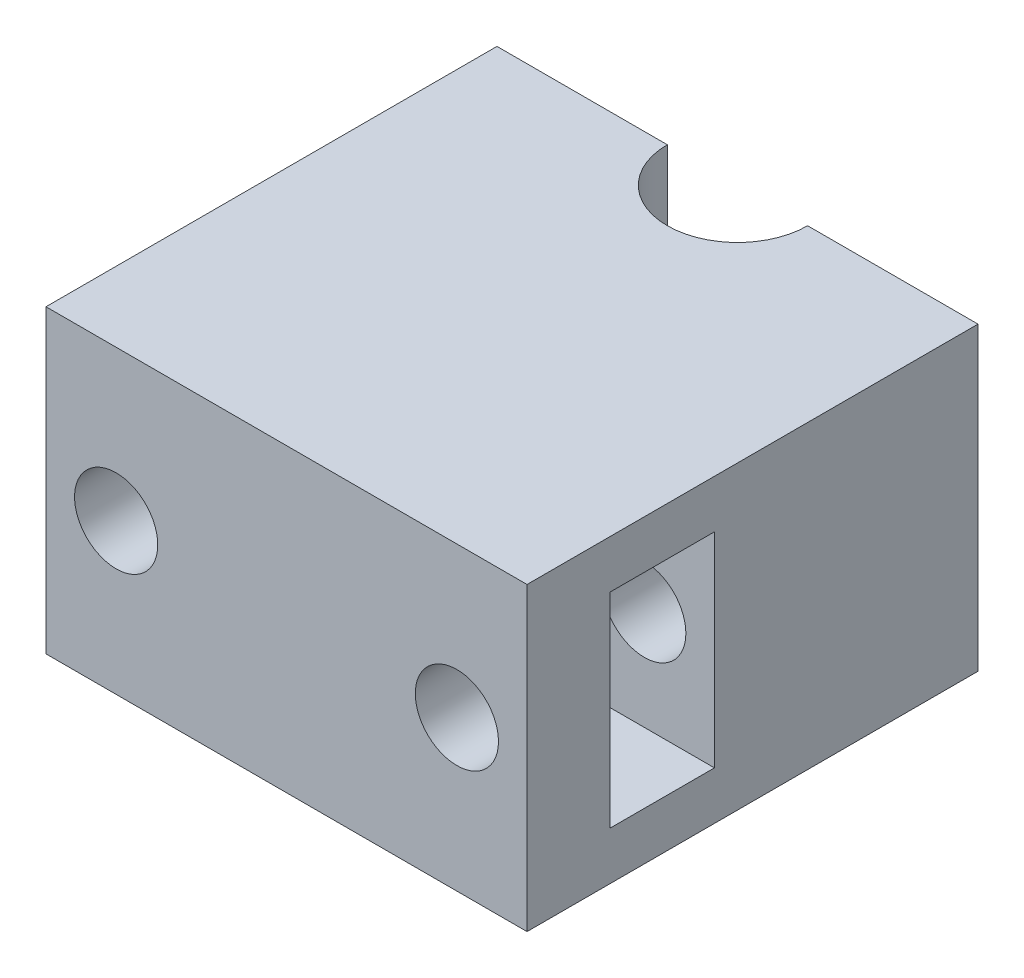
ISO-10303-21;
HEADER;
FILE_DESCRIPTION(('STEP AP214'),'2;1');
FILE_NAME('part.step','',(''),(''),'','','');
FILE_SCHEMA(('AUTOMOTIVE_DESIGN { 1 0 10303 214 1 1 1 1 }'));
ENDSEC;
DATA;
#1=APPLICATION_CONTEXT('core data for automotive mechanical design processes');
#2=APPLICATION_PROTOCOL_DEFINITION('international standard','automotive_design',2000,#1);
#3=PRODUCT_CONTEXT('',#1,'mechanical');
#4=PRODUCT('Part','Part','',(#3));
#5=PRODUCT_RELATED_PRODUCT_CATEGORY('part','',(#4));
#6=PRODUCT_DEFINITION_FORMATION('','',#4);
#7=PRODUCT_DEFINITION_CONTEXT('part definition',#1,'design');
#8=PRODUCT_DEFINITION('design','',#6,#7);
#9=PRODUCT_DEFINITION_SHAPE('','',#8);
#10=(LENGTH_UNIT() NAMED_UNIT(*) SI_UNIT(.MILLI.,.METRE.));
#11=(NAMED_UNIT(*) PLANE_ANGLE_UNIT() SI_UNIT($,.RADIAN.));
#12=(NAMED_UNIT(*) SI_UNIT($,.STERADIAN.) SOLID_ANGLE_UNIT());
#13=UNCERTAINTY_MEASURE_WITH_UNIT(LENGTH_MEASURE(1.E-05),#10,'distance_accuracy_value','');
#14=(GEOMETRIC_REPRESENTATION_CONTEXT(3) GLOBAL_UNCERTAINTY_ASSIGNED_CONTEXT((#13)) GLOBAL_UNIT_ASSIGNED_CONTEXT((#10,
#11,#12)) REPRESENTATION_CONTEXT('',''));
#15=CARTESIAN_POINT('',(0.,0.,0.));
#16=DIRECTION('',(0.,0.,1.));
#17=DIRECTION('',(1.,0.,0.));
#18=AXIS2_PLACEMENT_3D('',#15,#16,#17);
#19=CARTESIAN_POINT('',(24.,30.,-22.5));
#20=DIRECTION('',(0.,0.,1.));
#21=DIRECTION('',(1.,0.,0.));
#22=AXIS2_PLACEMENT_3D('',#19,#20,#21);
#23=PLANE('',#22);
#24=CARTESIAN_POINT('',(-17.,15.,-22.5));
#25=DIRECTION('',(0.,0.,1.));
#26=DIRECTION('',(1.,0.,0.));
#27=AXIS2_PLACEMENT_3D('',#24,#25,#26);
#28=CIRCLE('',#27,4.15);
#29=CARTESIAN_POINT('',(-12.85,15.,-22.5));
#30=VERTEX_POINT('',#29);
#31=EDGE_CURVE('E145',#30,#30,#28,.T.);
#32=ORIENTED_EDGE('',*,*,#31,.T.);
#33=EDGE_LOOP('',(#32));
#34=FACE_BOUND('',#33,.T.);
#35=DIRECTION('',(0.,-1.,0.));
#36=VECTOR('',#35,1.);
#37=CARTESIAN_POINT('',(-7.,157.889780948955,-22.5));
#38=LINE('',#37,#36);
#39=CARTESIAN_POINT('',(-7.,30.,-22.5));
#40=VERTEX_POINT('',#39);
#41=CARTESIAN_POINT('',(-7.,0.,-22.5));
#42=VERTEX_POINT('',#41);
#43=EDGE_CURVE('E126',#40,#42,#38,.T.);
#44=ORIENTED_EDGE('',*,*,#43,.T.);
#45=DIRECTION('',(-1.,0.,0.));
#46=VECTOR('',#45,1.);
#47=CARTESIAN_POINT('',(24.,0.,-22.5));
#48=LINE('',#47,#46);
#49=CARTESIAN_POINT('',(-24.,0.,-22.5));
#50=VERTEX_POINT('',#49);
#51=EDGE_CURVE('E113',#42,#50,#48,.T.);
#52=ORIENTED_EDGE('',*,*,#51,.T.);
#53=DIRECTION('',(0.,-1.,0.));
#54=VECTOR('',#53,1.);
#55=CARTESIAN_POINT('',(-24.,30.,-22.5));
#56=LINE('',#55,#54);
#57=CARTESIAN_POINT('',(-24.,30.,-22.5));
#58=VERTEX_POINT('',#57);
#59=EDGE_CURVE('E195',#58,#50,#56,.T.);
#60=ORIENTED_EDGE('',*,*,#59,.F.);
#61=DIRECTION('',(-1.,0.,0.));
#62=VECTOR('',#61,1.);
#63=CARTESIAN_POINT('',(24.,30.,-22.5));
#64=LINE('',#63,#62);
#65=EDGE_CURVE('E127',#40,#58,#64,.T.);
#66=ORIENTED_EDGE('',*,*,#65,.F.);
#67=EDGE_LOOP('',(#44,#52,#60,#66));
#68=FACE_BOUND('',#67,.T.);
#69=ADVANCED_FACE('F35',(#34,#68),#23,.F.);
#70=CARTESIAN_POINT('',(17.,15.,-22.5));
#71=DIRECTION('',(0.,0.,1.));
#72=DIRECTION('',(1.,0.,0.));
#73=AXIS2_PLACEMENT_3D('',#70,#71,#72);
#74=CIRCLE('',#73,4.15);
#75=CARTESIAN_POINT('',(21.15,15.,-22.5));
#76=VERTEX_POINT('',#75);
#77=EDGE_CURVE('E135',#76,#76,#74,.T.);
#78=ORIENTED_EDGE('',*,*,#77,.T.);
#79=EDGE_LOOP('',(#78));
#80=FACE_BOUND('',#79,.T.);
#81=DIRECTION('',(0.,-1.,0.));
#82=VECTOR('',#81,1.);
#83=CARTESIAN_POINT('',(7.,157.889780948955,-22.5));
#84=LINE('',#83,#82);
#85=CARTESIAN_POINT('',(7.,30.,-22.5));
#86=VERTEX_POINT('',#85);
#87=CARTESIAN_POINT('',(7.,0.,-22.5));
#88=VERTEX_POINT('',#87);
#89=EDGE_CURVE('E58',#86,#88,#84,.T.);
#90=ORIENTED_EDGE('',*,*,#89,.F.);
#91=CARTESIAN_POINT('',(24.,30.,-22.5));
#92=VERTEX_POINT('',#91);
#93=EDGE_CURVE('E193',#92,#86,#64,.T.);
#94=ORIENTED_EDGE('',*,*,#93,.F.);
#95=DIRECTION('',(0.,-1.,0.));
#96=VECTOR('',#95,1.);
#97=CARTESIAN_POINT('',(24.,30.,-22.5));
#98=LINE('',#97,#96);
#99=CARTESIAN_POINT('',(24.,0.,-22.5));
#100=VERTEX_POINT('',#99);
#101=EDGE_CURVE('E201',#92,#100,#98,.T.);
#102=ORIENTED_EDGE('',*,*,#101,.T.);
#103=EDGE_CURVE('E122',#100,#88,#48,.T.);
#104=ORIENTED_EDGE('',*,*,#103,.T.);
#105=EDGE_LOOP('',(#90,#94,#102,#104));
#106=FACE_BOUND('',#105,.T.);
#107=ADVANCED_FACE('F232',(#80,#106),#23,.F.);
#108=CARTESIAN_POINT('',(0.,30.,0.));
#109=DIRECTION('',(0.,1.,0.));
#110=DIRECTION('',(0.,0.,1.));
#111=AXIS2_PLACEMENT_3D('',#108,#109,#110);
#112=PLANE('',#111);
#113=ORIENTED_EDGE('',*,*,#93,.T.);
#114=CARTESIAN_POINT('',(0.,30.,-22.5));
#115=DIRECTION('',(0.,1.,0.));
#116=DIRECTION('',(0.,0.,1.));
#117=AXIS2_PLACEMENT_3D('',#114,#115,#116);
#118=CIRCLE('',#117,7.);
#119=EDGE_CURVE('E50',#86,#40,#118,.F.);
#120=ORIENTED_EDGE('',*,*,#119,.T.);
#121=ORIENTED_EDGE('',*,*,#65,.T.);
#122=DIRECTION('',(0.,0.,1.));
#123=VECTOR('',#122,1.);
#124=CARTESIAN_POINT('',(-24.,30.,22.5));
#125=LINE('',#124,#123);
#126=CARTESIAN_POINT('',(-24.,30.,22.5));
#127=VERTEX_POINT('',#126);
#128=EDGE_CURVE('E186',#58,#127,#125,.T.);
#129=ORIENTED_EDGE('',*,*,#128,.T.);
#130=DIRECTION('',(1.,0.,0.));
#131=VECTOR('',#130,1.);
#132=CARTESIAN_POINT('',(24.,30.,22.5));
#133=LINE('',#132,#131);
#134=CARTESIAN_POINT('',(24.,30.,22.5));
#135=VERTEX_POINT('',#134);
#136=EDGE_CURVE('E189',#127,#135,#133,.T.);
#137=ORIENTED_EDGE('',*,*,#136,.T.);
#138=DIRECTION('',(0.,0.,-1.));
#139=VECTOR('',#138,1.);
#140=CARTESIAN_POINT('',(24.,30.,22.5));
#141=LINE('',#140,#139);
#142=EDGE_CURVE('E191',#135,#92,#141,.T.);
#143=ORIENTED_EDGE('',*,*,#142,.T.);
#144=EDGE_LOOP('',(#113,#120,#121,#129,#137,#143));
#145=FACE_BOUND('',#144,.T.);
#146=ADVANCED_FACE('F238',(#145),#112,.T.);
#147=CARTESIAN_POINT('',(0.,0.,0.));
#148=DIRECTION('',(0.,1.,0.));
#149=DIRECTION('',(0.,0.,1.));
#150=AXIS2_PLACEMENT_3D('',#147,#148,#149);
#151=PLANE('',#150);
#152=CARTESIAN_POINT('',(0.,0.,-22.5));
#153=DIRECTION('',(0.,1.,0.));
#154=DIRECTION('',(0.,0.,1.));
#155=AXIS2_PLACEMENT_3D('',#152,#153,#154);
#156=CIRCLE('',#155,7.);
#157=EDGE_CURVE('E11',#88,#42,#156,.F.);
#158=ORIENTED_EDGE('',*,*,#157,.F.);
#159=ORIENTED_EDGE('',*,*,#103,.F.);
#160=DIRECTION('',(0.,0.,-1.));
#161=VECTOR('',#160,1.);
#162=CARTESIAN_POINT('',(24.,0.,22.5));
#163=LINE('',#162,#161);
#164=CARTESIAN_POINT('',(24.,0.,22.5));
#165=VERTEX_POINT('',#164);
#166=EDGE_CURVE('E123',#165,#100,#163,.T.);
#167=ORIENTED_EDGE('',*,*,#166,.F.);
#168=DIRECTION('',(1.,0.,0.));
#169=VECTOR('',#168,1.);
#170=CARTESIAN_POINT('',(24.,0.,22.5));
#171=LINE('',#170,#169);
#172=CARTESIAN_POINT('',(-24.,0.,22.5));
#173=VERTEX_POINT('',#172);
#174=EDGE_CURVE('E197',#173,#165,#171,.T.);
#175=ORIENTED_EDGE('',*,*,#174,.F.);
#176=DIRECTION('',(0.,0.,1.));
#177=VECTOR('',#176,1.);
#178=CARTESIAN_POINT('',(-24.,0.,22.5));
#179=LINE('',#178,#177);
#180=EDGE_CURVE('E118',#50,#173,#179,.T.);
#181=ORIENTED_EDGE('',*,*,#180,.F.);
#182=ORIENTED_EDGE('',*,*,#51,.F.);
#183=EDGE_LOOP('',(#158,#159,#167,#175,#181,#182));
#184=FACE_BOUND('',#183,.T.);
#185=ADVANCED_FACE('F115',(#184),#151,.F.);
#186=CARTESIAN_POINT('',(-24.,30.,22.5));
#187=DIRECTION('',(1.,0.,0.));
#188=DIRECTION('',(0.,0.,-1.));
#189=AXIS2_PLACEMENT_3D('',#186,#187,#188);
#190=PLANE('',#189);
#191=DIRECTION('',(0.,0.,-1.));
#192=VECTOR('',#191,1.);
#193=CARTESIAN_POINT('',(-24.,4.8,14.2));
#194=LINE('',#193,#192);
#195=CARTESIAN_POINT('',(-24.,4.8,14.2));
#196=VERTEX_POINT('',#195);
#197=CARTESIAN_POINT('',(-24.,4.8,3.80000000000001));
#198=VERTEX_POINT('',#197);
#199=EDGE_CURVE('E165',#196,#198,#194,.T.);
#200=ORIENTED_EDGE('',*,*,#199,.T.);
#201=DIRECTION('',(0.,1.,0.));
#202=VECTOR('',#201,1.);
#203=CARTESIAN_POINT('',(-24.,4.8,3.80000000000001));
#204=LINE('',#203,#202);
#205=CARTESIAN_POINT('',(-24.,25.2,3.80000000000001));
#206=VERTEX_POINT('',#205);
#207=EDGE_CURVE('E155',#198,#206,#204,.T.);
#208=ORIENTED_EDGE('',*,*,#207,.T.);
#209=DIRECTION('',(0.,0.,1.));
#210=VECTOR('',#209,1.);
#211=CARTESIAN_POINT('',(-24.,25.2,14.2));
#212=LINE('',#211,#210);
#213=CARTESIAN_POINT('',(-24.,25.2,14.2));
#214=VERTEX_POINT('',#213);
#215=EDGE_CURVE('E158',#206,#214,#212,.T.);
#216=ORIENTED_EDGE('',*,*,#215,.T.);
#217=DIRECTION('',(0.,-1.,0.));
#218=VECTOR('',#217,1.);
#219=CARTESIAN_POINT('',(-24.,4.8,14.2));
#220=LINE('',#219,#218);
#221=EDGE_CURVE('E162',#214,#196,#220,.T.);
#222=ORIENTED_EDGE('',*,*,#221,.T.);
#223=EDGE_LOOP('',(#200,#208,#216,#222));
#224=FACE_BOUND('',#223,.T.);
#225=ORIENTED_EDGE('',*,*,#180,.T.);
#226=DIRECTION('',(0.,-1.,0.));
#227=VECTOR('',#226,1.);
#228=CARTESIAN_POINT('',(-24.,30.,22.5));
#229=LINE('',#228,#227);
#230=EDGE_CURVE('E43',#127,#173,#229,.T.);
#231=ORIENTED_EDGE('',*,*,#230,.F.);
#232=ORIENTED_EDGE('',*,*,#128,.F.);
#233=ORIENTED_EDGE('',*,*,#59,.T.);
#234=EDGE_LOOP('',(#225,#231,#232,#233));
#235=FACE_BOUND('',#234,.T.);
#236=ADVANCED_FACE('F37',(#224,#235),#190,.F.);
#237=CARTESIAN_POINT('',(24.,30.,22.5));
#238=DIRECTION('',(0.,0.,-1.));
#239=DIRECTION('',(-1.,0.,0.));
#240=AXIS2_PLACEMENT_3D('',#237,#238,#239);
#241=PLANE('',#240);
#242=CARTESIAN_POINT('',(17.,15.,22.5));
#243=DIRECTION('',(0.,0.,1.));
#244=DIRECTION('',(1.,0.,0.));
#245=AXIS2_PLACEMENT_3D('',#242,#243,#244);
#246=CIRCLE('',#245,4.15);
#247=CARTESIAN_POINT('',(21.15,15.,22.5));
#248=VERTEX_POINT('',#247);
#249=EDGE_CURVE('E132',#248,#248,#246,.T.);
#250=ORIENTED_EDGE('',*,*,#249,.F.);
#251=EDGE_LOOP('',(#250));
#252=FACE_BOUND('',#251,.T.);
#253=CARTESIAN_POINT('',(-17.,15.,22.5));
#254=DIRECTION('',(0.,0.,1.));
#255=DIRECTION('',(1.,0.,0.));
#256=AXIS2_PLACEMENT_3D('',#253,#254,#255);
#257=CIRCLE('',#256,4.15);
#258=CARTESIAN_POINT('',(-12.85,15.,22.5));
#259=VERTEX_POINT('',#258);
#260=EDGE_CURVE('E144',#259,#259,#257,.T.);
#261=ORIENTED_EDGE('',*,*,#260,.F.);
#262=EDGE_LOOP('',(#261));
#263=FACE_BOUND('',#262,.T.);
#264=ORIENTED_EDGE('',*,*,#174,.T.);
#265=DIRECTION('',(0.,-1.,0.));
#266=VECTOR('',#265,1.);
#267=CARTESIAN_POINT('',(24.,30.,22.5));
#268=LINE('',#267,#266);
#269=EDGE_CURVE('E204',#135,#165,#268,.T.);
#270=ORIENTED_EDGE('',*,*,#269,.F.);
#271=ORIENTED_EDGE('',*,*,#136,.F.);
#272=ORIENTED_EDGE('',*,*,#230,.T.);
#273=EDGE_LOOP('',(#264,#270,#271,#272));
#274=FACE_BOUND('',#273,.T.);
#275=ADVANCED_FACE('F246',(#252,#263,#274),#241,.F.);
#276=CARTESIAN_POINT('',(24.,30.,22.5));
#277=DIRECTION('',(-1.,0.,0.));
#278=DIRECTION('',(0.,0.,1.));
#279=AXIS2_PLACEMENT_3D('',#276,#277,#278);
#280=PLANE('',#279);
#281=DIRECTION('',(0.,0.,1.));
#282=VECTOR('',#281,1.);
#283=CARTESIAN_POINT('',(24.,25.2,14.2));
#284=LINE('',#283,#282);
#285=CARTESIAN_POINT('',(24.,25.2,3.80000000000001));
#286=VERTEX_POINT('',#285);
#287=CARTESIAN_POINT('',(24.,25.2,14.2));
#288=VERTEX_POINT('',#287);
#289=EDGE_CURVE('E170',#286,#288,#284,.T.);
#290=ORIENTED_EDGE('',*,*,#289,.F.);
#291=DIRECTION('',(0.,1.,0.));
#292=VECTOR('',#291,1.);
#293=CARTESIAN_POINT('',(24.,4.8,3.80000000000001));
#294=LINE('',#293,#292);
#295=CARTESIAN_POINT('',(24.,4.8,3.80000000000001));
#296=VERTEX_POINT('',#295);
#297=EDGE_CURVE('E154',#296,#286,#294,.T.);
#298=ORIENTED_EDGE('',*,*,#297,.F.);
#299=DIRECTION('',(0.,0.,-1.));
#300=VECTOR('',#299,1.);
#301=CARTESIAN_POINT('',(24.,4.8,14.2));
#302=LINE('',#301,#300);
#303=CARTESIAN_POINT('',(24.,4.8,14.2));
#304=VERTEX_POINT('',#303);
#305=EDGE_CURVE('E159',#304,#296,#302,.T.);
#306=ORIENTED_EDGE('',*,*,#305,.F.);
#307=DIRECTION('',(0.,-1.,0.));
#308=VECTOR('',#307,1.);
#309=CARTESIAN_POINT('',(24.,4.8,14.2));
#310=LINE('',#309,#308);
#311=EDGE_CURVE('E173',#288,#304,#310,.T.);
#312=ORIENTED_EDGE('',*,*,#311,.F.);
#313=EDGE_LOOP('',(#290,#298,#306,#312));
#314=FACE_BOUND('',#313,.T.);
#315=ORIENTED_EDGE('',*,*,#166,.T.);
#316=ORIENTED_EDGE('',*,*,#101,.F.);
#317=ORIENTED_EDGE('',*,*,#142,.F.);
#318=ORIENTED_EDGE('',*,*,#269,.T.);
#319=EDGE_LOOP('',(#315,#316,#317,#318));
#320=FACE_BOUND('',#319,.T.);
#321=ADVANCED_FACE('F243',(#314,#320),#280,.F.);
#322=CARTESIAN_POINT('',(-24.,4.8,3.80000000000001));
#323=DIRECTION('',(0.,0.,-1.));
#324=DIRECTION('',(-1.,0.,0.));
#325=AXIS2_PLACEMENT_3D('',#322,#323,#324);
#326=PLANE('',#325);
#327=CARTESIAN_POINT('',(17.,15.,3.80000000000001));
#328=DIRECTION('',(0.,0.,-1.));
#329=DIRECTION('',(-1.,0.,0.));
#330=AXIS2_PLACEMENT_3D('',#327,#328,#329);
#331=CIRCLE('',#330,4.15);
#332=CARTESIAN_POINT('',(12.85,15.,3.80000000000001));
#333=VERTEX_POINT('',#332);
#334=EDGE_CURVE('E141',#333,#333,#331,.T.);
#335=ORIENTED_EDGE('',*,*,#334,.T.);
#336=EDGE_LOOP('',(#335));
#337=FACE_BOUND('',#336,.T.);
#338=CARTESIAN_POINT('',(-17.,15.,3.80000000000001));
#339=DIRECTION('',(0.,0.,-1.));
#340=DIRECTION('',(-1.,0.,0.));
#341=AXIS2_PLACEMENT_3D('',#338,#339,#340);
#342=CIRCLE('',#341,4.15);
#343=CARTESIAN_POINT('',(-21.15,15.,3.80000000000001));
#344=VERTEX_POINT('',#343);
#345=EDGE_CURVE('E151',#344,#344,#342,.T.);
#346=ORIENTED_EDGE('',*,*,#345,.T.);
#347=EDGE_LOOP('',(#346));
#348=FACE_BOUND('',#347,.T.);
#349=ORIENTED_EDGE('',*,*,#297,.T.);
#350=DIRECTION('',(1.,0.,0.));
#351=VECTOR('',#350,1.);
#352=CARTESIAN_POINT('',(-24.,25.2,3.80000000000001));
#353=LINE('',#352,#351);
#354=EDGE_CURVE('E168',#206,#286,#353,.T.);
#355=ORIENTED_EDGE('',*,*,#354,.F.);
#356=ORIENTED_EDGE('',*,*,#207,.F.);
#357=DIRECTION('',(1.,0.,0.));
#358=VECTOR('',#357,1.);
#359=CARTESIAN_POINT('',(-24.,4.8,3.80000000000001));
#360=LINE('',#359,#358);
#361=EDGE_CURVE('E178',#198,#296,#360,.T.);
#362=ORIENTED_EDGE('',*,*,#361,.T.);
#363=EDGE_LOOP('',(#349,#355,#356,#362));
#364=FACE_BOUND('',#363,.T.);
#365=ADVANCED_FACE('F245',(#337,#348,#364),#326,.F.);
#366=CARTESIAN_POINT('',(-24.,4.8,14.2));
#367=DIRECTION('',(0.,-1.,0.));
#368=DIRECTION('',(0.,0.,-1.));
#369=AXIS2_PLACEMENT_3D('',#366,#367,#368);
#370=PLANE('',#369);
#371=ORIENTED_EDGE('',*,*,#305,.T.);
#372=ORIENTED_EDGE('',*,*,#361,.F.);
#373=ORIENTED_EDGE('',*,*,#199,.F.);
#374=DIRECTION('',(1.,0.,0.));
#375=VECTOR('',#374,1.);
#376=CARTESIAN_POINT('',(-24.,4.8,14.2));
#377=LINE('',#376,#375);
#378=EDGE_CURVE('E180',#196,#304,#377,.T.);
#379=ORIENTED_EDGE('',*,*,#378,.T.);
#380=EDGE_LOOP('',(#371,#372,#373,#379));
#381=FACE_BOUND('',#380,.T.);
#382=ADVANCED_FACE('F273',(#381),#370,.F.);
#383=CARTESIAN_POINT('',(-24.,4.8,14.2));
#384=DIRECTION('',(0.,0.,1.));
#385=DIRECTION('',(1.,0.,0.));
#386=AXIS2_PLACEMENT_3D('',#383,#384,#385);
#387=PLANE('',#386);
#388=CARTESIAN_POINT('',(17.,15.,14.2));
#389=DIRECTION('',(0.,0.,1.));
#390=DIRECTION('',(1.,0.,0.));
#391=AXIS2_PLACEMENT_3D('',#388,#389,#390);
#392=CIRCLE('',#391,4.15);
#393=CARTESIAN_POINT('',(21.15,15.,14.2));
#394=VERTEX_POINT('',#393);
#395=EDGE_CURVE('E138',#394,#394,#392,.T.);
#396=ORIENTED_EDGE('',*,*,#395,.T.);
#397=EDGE_LOOP('',(#396));
#398=FACE_BOUND('',#397,.T.);
#399=CARTESIAN_POINT('',(-17.,15.,14.2));
#400=DIRECTION('',(0.,0.,1.));
#401=DIRECTION('',(1.,0.,0.));
#402=AXIS2_PLACEMENT_3D('',#399,#400,#401);
#403=CIRCLE('',#402,4.15);
#404=CARTESIAN_POINT('',(-12.85,15.,14.2));
#405=VERTEX_POINT('',#404);
#406=EDGE_CURVE('E148',#405,#405,#403,.T.);
#407=ORIENTED_EDGE('',*,*,#406,.T.);
#408=EDGE_LOOP('',(#407));
#409=FACE_BOUND('',#408,.T.);
#410=ORIENTED_EDGE('',*,*,#311,.T.);
#411=ORIENTED_EDGE('',*,*,#378,.F.);
#412=ORIENTED_EDGE('',*,*,#221,.F.);
#413=DIRECTION('',(1.,0.,0.));
#414=VECTOR('',#413,1.);
#415=CARTESIAN_POINT('',(-24.,25.2,14.2));
#416=LINE('',#415,#414);
#417=EDGE_CURVE('E182',#214,#288,#416,.T.);
#418=ORIENTED_EDGE('',*,*,#417,.T.);
#419=EDGE_LOOP('',(#410,#411,#412,#418));
#420=FACE_BOUND('',#419,.T.);
#421=ADVANCED_FACE('F213',(#398,#409,#420),#387,.F.);
#422=CARTESIAN_POINT('',(-24.,25.2,14.2));
#423=DIRECTION('',(0.,1.,0.));
#424=DIRECTION('',(0.,0.,1.));
#425=AXIS2_PLACEMENT_3D('',#422,#423,#424);
#426=PLANE('',#425);
#427=ORIENTED_EDGE('',*,*,#289,.T.);
#428=ORIENTED_EDGE('',*,*,#417,.F.);
#429=ORIENTED_EDGE('',*,*,#215,.F.);
#430=ORIENTED_EDGE('',*,*,#354,.T.);
#431=EDGE_LOOP('',(#427,#428,#429,#430));
#432=FACE_BOUND('',#431,.T.);
#433=ADVANCED_FACE('F275',(#432),#426,.F.);
#434=CARTESIAN_POINT('',(-17.,15.,-22.5));
#435=DIRECTION('',(0.,0.,1.));
#436=DIRECTION('',(1.,0.,0.));
#437=AXIS2_PLACEMENT_3D('',#434,#435,#436);
#438=CYLINDRICAL_SURFACE('',#437,4.15);
#439=ORIENTED_EDGE('',*,*,#260,.T.);
#440=EDGE_LOOP('',(#439));
#441=FACE_BOUND('',#440,.T.);
#442=ORIENTED_EDGE('',*,*,#406,.F.);
#443=EDGE_LOOP('',(#442));
#444=FACE_BOUND('',#443,.T.);
#445=ADVANCED_FACE('F227',(#441,#444),#438,.F.);
#446=ORIENTED_EDGE('',*,*,#31,.F.);
#447=EDGE_LOOP('',(#446));
#448=FACE_BOUND('',#447,.T.);
#449=ORIENTED_EDGE('',*,*,#345,.F.);
#450=EDGE_LOOP('',(#449));
#451=FACE_BOUND('',#450,.T.);
#452=ADVANCED_FACE('F219',(#448,#451),#438,.F.);
#453=CARTESIAN_POINT('',(17.,15.,-22.5));
#454=DIRECTION('',(0.,0.,1.));
#455=DIRECTION('',(1.,0.,0.));
#456=AXIS2_PLACEMENT_3D('',#453,#454,#455);
#457=CYLINDRICAL_SURFACE('',#456,4.15);
#458=ORIENTED_EDGE('',*,*,#249,.T.);
#459=EDGE_LOOP('',(#458));
#460=FACE_BOUND('',#459,.T.);
#461=ORIENTED_EDGE('',*,*,#395,.F.);
#462=EDGE_LOOP('',(#461));
#463=FACE_BOUND('',#462,.T.);
#464=ADVANCED_FACE('F216',(#460,#463),#457,.F.);
#465=ORIENTED_EDGE('',*,*,#77,.F.);
#466=EDGE_LOOP('',(#465));
#467=FACE_BOUND('',#466,.T.);
#468=ORIENTED_EDGE('',*,*,#334,.F.);
#469=EDGE_LOOP('',(#468));
#470=FACE_BOUND('',#469,.T.);
#471=ADVANCED_FACE('F218',(#467,#470),#457,.F.);
#472=CARTESIAN_POINT('',(0.,157.889780948955,-22.5));
#473=DIRECTION('',(0.,-1.,0.));
#474=DIRECTION('',(0.,0.,-1.));
#475=AXIS2_PLACEMENT_3D('',#472,#473,#474);
#476=CYLINDRICAL_SURFACE('',#475,7.);
#477=ORIENTED_EDGE('',*,*,#119,.F.);
#478=ORIENTED_EDGE('',*,*,#89,.T.);
#479=ORIENTED_EDGE('',*,*,#157,.T.);
#480=ORIENTED_EDGE('',*,*,#43,.F.);
#481=EDGE_LOOP('',(#477,#478,#479,#480));
#482=FACE_BOUND('',#481,.T.);
#483=ADVANCED_FACE('F130',(#482),#476,.F.);
#484=CLOSED_SHELL('',(#69,#107,#146,#185,#236,#275,#321,#365,#382,#421,#433,#445,#452,#464,#471,#483));
#485=MANIFOLD_SOLID_BREP('B2',#484);
#486=ADVANCED_BREP_SHAPE_REPRESENTATION('',(#18,#485),#14);
#487=SHAPE_DEFINITION_REPRESENTATION(#9,#486);
ENDSEC;
END-ISO-10303-21;
